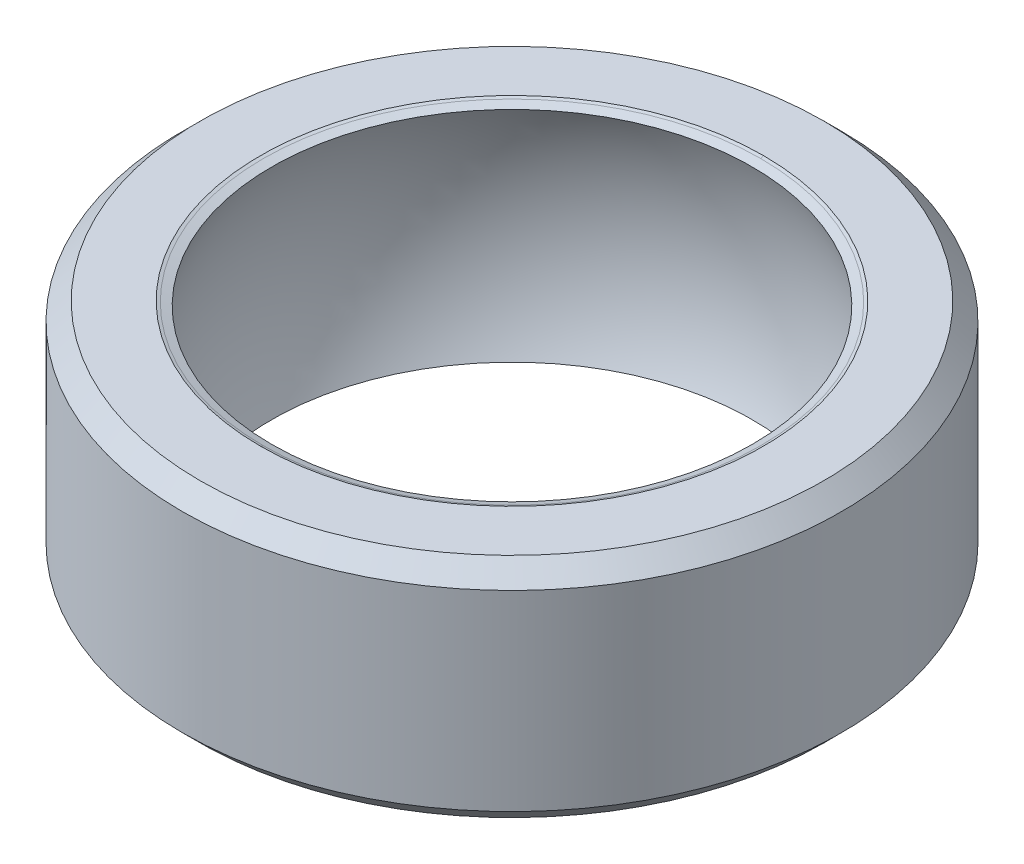
ISO-10303-21;
HEADER;
FILE_DESCRIPTION(('STEP AP214'),'2;1');
FILE_NAME('part.step','',(''),(''),'','','');
FILE_SCHEMA(('AUTOMOTIVE_DESIGN { 1 0 10303 214 1 1 1 1 }'));
ENDSEC;
DATA;
#1=APPLICATION_CONTEXT('core data for automotive mechanical design processes');
#2=APPLICATION_PROTOCOL_DEFINITION('international standard','automotive_design',2000,#1);
#3=PRODUCT_CONTEXT('',#1,'mechanical');
#4=PRODUCT('Part','Part','',(#3));
#5=PRODUCT_RELATED_PRODUCT_CATEGORY('part','',(#4));
#6=PRODUCT_DEFINITION_FORMATION('','',#4);
#7=PRODUCT_DEFINITION_CONTEXT('part definition',#1,'design');
#8=PRODUCT_DEFINITION('design','',#6,#7);
#9=PRODUCT_DEFINITION_SHAPE('','',#8);
#10=(LENGTH_UNIT() NAMED_UNIT(*) SI_UNIT(.MILLI.,.METRE.));
#11=(NAMED_UNIT(*) PLANE_ANGLE_UNIT() SI_UNIT($,.RADIAN.));
#12=(NAMED_UNIT(*) SI_UNIT($,.STERADIAN.) SOLID_ANGLE_UNIT());
#13=UNCERTAINTY_MEASURE_WITH_UNIT(LENGTH_MEASURE(1.E-05),#10,'distance_accuracy_value','');
#14=(GEOMETRIC_REPRESENTATION_CONTEXT(3) GLOBAL_UNCERTAINTY_ASSIGNED_CONTEXT((#13)) GLOBAL_UNIT_ASSIGNED_CONTEXT((#10,
#11,#12)) REPRESENTATION_CONTEXT('',''));
#15=CARTESIAN_POINT('',(0.,0.,0.));
#16=DIRECTION('',(0.,0.,1.));
#17=DIRECTION('',(1.,0.,0.));
#18=AXIS2_PLACEMENT_3D('',#15,#16,#17);
#19=CARTESIAN_POINT('',(0.,0.,0.));
#20=DIRECTION('',(0.,-1.,0.));
#21=DIRECTION('',(0.,0.,-1.));
#22=AXIS2_PLACEMENT_3D('',#19,#20,#21);
#23=DEGENERATE_TOROIDAL_SURFACE('',#22,0.00762000000000092,7.52422121857329,.T.);
#24=CARTESIAN_POINT('',(0.,3.12138692186181,0.));
#25=DIRECTION('',(0.,1.,0.));
#26=DIRECTION('',(1.,0.,0.));
#27=AXIS2_PLACEMENT_3D('',#24,#25,#26);
#28=CIRCLE('',#27,6.85384878886452);
#29=CARTESIAN_POINT('',(6.85384878886452,3.12138692186181,0.));
#30=VERTEX_POINT('',#29);
#31=EDGE_CURVE('E125',#30,#30,#28,.T.);
#32=ORIENTED_EDGE('',*,*,#31,.T.);
#33=EDGE_LOOP('',(#32));
#34=FACE_BOUND('',#33,.T.);
#35=CARTESIAN_POINT('',(0.,-3.12138692189023,0.));
#36=DIRECTION('',(0.,-1.,0.));
#37=DIRECTION('',(1.,0.,0.));
#38=AXIS2_PLACEMENT_3D('',#35,#36,#37);
#39=CIRCLE('',#38,6.85384878880768);
#40=CARTESIAN_POINT('',(6.85384878880768,-3.12138692189023,0.));
#41=VERTEX_POINT('',#40);
#42=EDGE_CURVE('E129',#41,#41,#39,.T.);
#43=ORIENTED_EDGE('',*,*,#42,.T.);
#44=EDGE_LOOP('',(#43));
#45=FACE_BOUND('',#44,.T.);
#46=ADVANCED_FACE('F16',(#34,#45),#23,.F.);
#47=CARTESIAN_POINT('',(0.,-3.20848073371849,0.));
#48=DIRECTION('',(0.,-1.,0.));
#49=DIRECTION('',(1.,0.,0.));
#50=AXIS2_PLACEMENT_3D('',#47,#48,#49);
#51=CONICAL_SURFACE('',#50,7.09326707806213,1.22190500926642);
#52=ORIENTED_EDGE('',*,*,#42,.F.);
#53=EDGE_LOOP('',(#52));
#54=FACE_BOUND('',#53,.T.);
#55=CARTESIAN_POINT('',(0.,-3.2084807338012,0.));
#56=DIRECTION('',(0.,-1.,0.));
#57=DIRECTION('',(-1.,0.,0.));
#58=AXIS2_PLACEMENT_3D('',#55,#56,#57);
#59=CIRCLE('',#58,7.0932670782895);
#60=CARTESIAN_POINT('',(-7.09326914803703,-3.20847333234299,0.));
#61=VERTEX_POINT('',#60);
#62=CARTESIAN_POINT('',(0.,-3.20847345069136,-7.09326951839364));
#63=VERTEX_POINT('',#62);
#64=EDGE_CURVE('E365',#61,#63,#59,.T.);
#65=ORIENTED_EDGE('',*,*,#64,.T.);
#66=CARTESIAN_POINT('',(0.,-3.2084807338012,0.));
#67=DIRECTION('',(0.,-1.,0.));
#68=DIRECTION('',(0.,0.,-1.));
#69=AXIS2_PLACEMENT_3D('',#66,#67,#68);
#70=CIRCLE('',#69,7.0932670782895);
#71=CARTESIAN_POINT('',(0.,-3.20847343916724,7.09326941906428));
#72=VERTEX_POINT('',#71);
#73=EDGE_CURVE('E68',#63,#72,#70,.T.);
#74=ORIENTED_EDGE('',*,*,#73,.T.);
#75=CARTESIAN_POINT('',(0.,-3.20848033326683,0.));
#76=DIRECTION('',(0.,-1.,0.));
#77=DIRECTION('',(0.,0.,1.));
#78=AXIS2_PLACEMENT_3D('',#75,#76,#77);
#79=CIRCLE('',#78,7.09326597723248);
#80=EDGE_CURVE('E128',#72,#61,#79,.T.);
#81=ORIENTED_EDGE('',*,*,#80,.T.);
#82=EDGE_LOOP('',(#65,#74,#81));
#83=FACE_BOUND('',#82,.T.);
#84=ADVANCED_FACE('F267',(#54,#83),#51,.F.);
#85=CARTESIAN_POINT('',(0.,3.20848073371849,0.));
#86=DIRECTION('',(0.,1.,0.));
#87=DIRECTION('',(0.,0.,1.));
#88=AXIS2_PLACEMENT_3D('',#85,#86,#87);
#89=CONICAL_SURFACE('',#88,7.09326707823266,1.22190500937126);
#90=ORIENTED_EDGE('',*,*,#31,.F.);
#91=EDGE_LOOP('',(#90));
#92=FACE_BOUND('',#91,.T.);
#93=CARTESIAN_POINT('',(0.,3.20848073371849,0.));
#94=DIRECTION('',(0.,1.,0.));
#95=DIRECTION('',(-1.,0.,0.));
#96=AXIS2_PLACEMENT_3D('',#93,#94,#95);
#97=CIRCLE('',#96,7.09326707823266);
#98=CARTESIAN_POINT('',(-7.09326914800861,3.20847333230164,0.));
#99=VERTEX_POINT('',#98);
#100=CARTESIAN_POINT('',(0.,3.20847338417803,7.0932693357914));
#101=VERTEX_POINT('',#100);
#102=EDGE_CURVE('E53',#99,#101,#97,.T.);
#103=ORIENTED_EDGE('',*,*,#102,.T.);
#104=CARTESIAN_POINT('',(0.,3.20848073371849,0.));
#105=DIRECTION('',(0.,1.,0.));
#106=DIRECTION('',(0.,0.,1.));
#107=AXIS2_PLACEMENT_3D('',#104,#105,#106);
#108=CIRCLE('',#107,7.09326707823266);
#109=CARTESIAN_POINT('',(0.,3.20847343912586,-7.09326941903571));
#110=VERTEX_POINT('',#109);
#111=EDGE_CURVE('E71',#101,#110,#108,.T.);
#112=ORIENTED_EDGE('',*,*,#111,.T.);
#113=CARTESIAN_POINT('',(0.,3.20848033318412,0.));
#114=DIRECTION('',(0.,1.,0.));
#115=DIRECTION('',(0.,0.,-1.));
#116=AXIS2_PLACEMENT_3D('',#113,#114,#115);
#117=CIRCLE('',#116,7.09326597717563);
#118=EDGE_CURVE('E76',#110,#99,#117,.T.);
#119=ORIENTED_EDGE('',*,*,#118,.T.);
#120=EDGE_LOOP('',(#103,#112,#119));
#121=FACE_BOUND('',#120,.T.);
#122=ADVANCED_FACE('F74',(#92,#121),#89,.F.);
#123=CARTESIAN_POINT('',(0.,-3.23849999992376,0.));
#124=DIRECTION('',(0.,-1.,0.));
#125=DIRECTION('',(1.,0.,0.));
#126=AXIS2_PLACEMENT_3D('',#123,#124,#125);
#127=CONICAL_SURFACE('',#126,7.17578914486694,1.22173047635966);
#128=ORIENTED_EDGE('',*,*,#64,.F.);
#129=ORIENTED_EDGE('',*,*,#80,.F.);
#130=DIRECTION('',(0.,0.34202014332567,-0.939692620785908));
#131=VECTOR('',#130,1.);
#132=CARTESIAN_POINT('',(5.10278230133358E-11,-181621.773625179,499000.));
#133=LINE('',#132,#131);
#134=CARTESIAN_POINT('',(0.,-3.23849999998583,7.17578914503747));
#135=VERTEX_POINT('',#134);
#136=EDGE_CURVE('E133',#72,#135,#133,.F.);
#137=ORIENTED_EDGE('',*,*,#136,.T.);
#138=CARTESIAN_POINT('',(0.,-3.23849999998583,0.));
#139=DIRECTION('',(0.,-1.,0.));
#140=DIRECTION('',(1.,0.,0.));
#141=AXIS2_PLACEMENT_3D('',#138,#139,#140);
#142=CIRCLE('',#141,7.17578914503747);
#143=CARTESIAN_POINT('',(0.,-3.23849999998583,-7.17578914503747));
#144=VERTEX_POINT('',#143);
#145=EDGE_CURVE('E19',#144,#135,#142,.F.);
#146=ORIENTED_EDGE('',*,*,#145,.F.);
#147=DIRECTION('',(0.,0.342020143325669,0.939692620785908));
#148=VECTOR('',#147,1.);
#149=CARTESIAN_POINT('',(-1.00820522641172E-11,-181621.773625179,-499000.));
#150=LINE('',#149,#148);
#151=EDGE_CURVE('E79',#144,#63,#150,.T.);
#152=ORIENTED_EDGE('',*,*,#151,.T.);
#153=EDGE_LOOP('',(#128,#129,#137,#146,#152));
#154=FACE_BOUND('',#153,.T.);
#155=ADVANCED_FACE('F250',(#154),#127,.F.);
#156=CARTESIAN_POINT('',(0.,-3.23849999992376,0.));
#157=DIRECTION('',(0.,-1.,0.));
#158=DIRECTION('',(1.,0.,0.));
#159=AXIS2_PLACEMENT_3D('',#156,#157,#158);
#160=CONICAL_SURFACE('',#159,7.17578914486694,1.22173047630567);
#161=CARTESIAN_POINT('',(0.,-3.23849999998583,0.));
#162=DIRECTION('',(0.,-1.,0.));
#163=DIRECTION('',(1.,0.,0.));
#164=AXIS2_PLACEMENT_3D('',#161,#162,#163);
#165=CIRCLE('',#164,7.17578914503747);
#166=EDGE_CURVE('E160',#135,#144,#165,.F.);
#167=ORIENTED_EDGE('',*,*,#166,.F.);
#168=ORIENTED_EDGE('',*,*,#136,.F.);
#169=ORIENTED_EDGE('',*,*,#73,.F.);
#170=ORIENTED_EDGE('',*,*,#151,.F.);
#171=EDGE_LOOP('',(#167,#168,#169,#170));
#172=FACE_BOUND('',#171,.T.);
#173=ADVANCED_FACE('F242',(#172),#160,.F.);
#174=CARTESIAN_POINT('',(0.,3.23849999992376,0.));
#175=DIRECTION('',(0.,1.,0.));
#176=DIRECTION('',(-1.,0.,0.));
#177=AXIS2_PLACEMENT_3D('',#174,#175,#176);
#178=CONICAL_SURFACE('',#177,7.17578914486694,1.22173047630567);
#179=ORIENTED_EDGE('',*,*,#111,.F.);
#180=DIRECTION('',(0.,-0.34202014332567,-0.939692620785908));
#181=VECTOR('',#180,1.);
#182=CARTESIAN_POINT('',(-2.58227915002348E-11,181621.773625179,499000.));
#183=LINE('',#182,#181);
#184=CARTESIAN_POINT('',(0.,3.23849999998583,7.17578914503747));
#185=VERTEX_POINT('',#184);
#186=EDGE_CURVE('E34',#101,#185,#183,.F.);
#187=ORIENTED_EDGE('',*,*,#186,.T.);
#188=CARTESIAN_POINT('',(0.,3.23849999998583,0.));
#189=DIRECTION('',(0.,1.,0.));
#190=DIRECTION('',(-1.,0.,0.));
#191=AXIS2_PLACEMENT_3D('',#188,#189,#190);
#192=CIRCLE('',#191,7.17578914503747);
#193=CARTESIAN_POINT('',(0.,3.23849999998583,-7.17578914503747));
#194=VERTEX_POINT('',#193);
#195=EDGE_CURVE('E86',#194,#185,#192,.F.);
#196=ORIENTED_EDGE('',*,*,#195,.F.);
#197=DIRECTION('',(0.,-0.342020143325669,0.939692620785908));
#198=VECTOR('',#197,1.);
#199=CARTESIAN_POINT('',(3.52870837772181E-11,181621.773625179,-499000.));
#200=LINE('',#199,#198);
#201=EDGE_CURVE('E83',#194,#110,#200,.T.);
#202=ORIENTED_EDGE('',*,*,#201,.T.);
#203=EDGE_LOOP('',(#179,#187,#196,#202));
#204=FACE_BOUND('',#203,.T.);
#205=ADVANCED_FACE('F84',(#204),#178,.F.);
#206=CARTESIAN_POINT('',(0.,3.23849999992376,0.));
#207=DIRECTION('',(0.,1.,0.));
#208=DIRECTION('',(-1.,0.,0.));
#209=AXIS2_PLACEMENT_3D('',#206,#207,#208);
#210=CONICAL_SURFACE('',#209,7.17578914486694,1.22173047635966);
#211=CARTESIAN_POINT('',(0.,3.23849999998583,0.));
#212=DIRECTION('',(0.,1.,0.));
#213=DIRECTION('',(-1.,0.,0.));
#214=AXIS2_PLACEMENT_3D('',#211,#212,#213);
#215=CIRCLE('',#214,7.17578914503747);
#216=EDGE_CURVE('E152',#185,#194,#215,.F.);
#217=ORIENTED_EDGE('',*,*,#216,.F.);
#218=ORIENTED_EDGE('',*,*,#186,.F.);
#219=ORIENTED_EDGE('',*,*,#102,.F.);
#220=ORIENTED_EDGE('',*,*,#118,.F.);
#221=ORIENTED_EDGE('',*,*,#201,.F.);
#222=EDGE_LOOP('',(#217,#218,#219,#220,#221));
#223=FACE_BOUND('',#222,.T.);
#224=ADVANCED_FACE('F91',(#223),#210,.F.);
#225=CARTESIAN_POINT('',(0.,-3.2385,0.));
#226=DIRECTION('',(0.,-1.,0.));
#227=DIRECTION('',(0.,0.,-1.));
#228=AXIS2_PLACEMENT_3D('',#225,#226,#227);
#229=PLANE('',#228);
#230=CARTESIAN_POINT('',(0.,-3.2385,0.));
#231=DIRECTION('',(0.,1.,0.));
#232=DIRECTION('',(-1.,0.,0.));
#233=AXIS2_PLACEMENT_3D('',#230,#231,#232);
#234=CIRCLE('',#233,8.89);
#235=CARTESIAN_POINT('',(-8.89,-3.2385,0.));
#236=VERTEX_POINT('',#235);
#237=EDGE_CURVE('E147',#236,#236,#234,.T.);
#238=ORIENTED_EDGE('',*,*,#237,.F.);
#239=EDGE_LOOP('',(#238));
#240=FACE_BOUND('',#239,.T.);
#241=ORIENTED_EDGE('',*,*,#145,.T.);
#242=ORIENTED_EDGE('',*,*,#166,.T.);
#243=EDGE_LOOP('',(#241,#242));
#244=FACE_BOUND('',#243,.T.);
#245=ADVANCED_FACE('F111',(#240,#244),#229,.T.);
#246=CARTESIAN_POINT('',(0.,3.2385,0.));
#247=DIRECTION('',(0.,1.,0.));
#248=DIRECTION('',(0.,0.,1.));
#249=AXIS2_PLACEMENT_3D('',#246,#247,#248);
#250=PLANE('',#249);
#251=CARTESIAN_POINT('',(0.,3.2385,0.));
#252=DIRECTION('',(0.,-1.,0.));
#253=DIRECTION('',(0.,0.,-1.));
#254=AXIS2_PLACEMENT_3D('',#251,#252,#253);
#255=CIRCLE('',#254,8.89);
#256=CARTESIAN_POINT('',(0.,3.2385,-8.89));
#257=VERTEX_POINT('',#256);
#258=EDGE_CURVE('E143',#257,#257,#255,.T.);
#259=ORIENTED_EDGE('',*,*,#258,.F.);
#260=EDGE_LOOP('',(#259));
#261=FACE_BOUND('',#260,.T.);
#262=ORIENTED_EDGE('',*,*,#195,.T.);
#263=ORIENTED_EDGE('',*,*,#216,.T.);
#264=EDGE_LOOP('',(#262,#263));
#265=FACE_BOUND('',#264,.T.);
#266=ADVANCED_FACE('F165',(#261,#265),#250,.T.);
#267=CARTESIAN_POINT('',(0.,-2.7305,0.));
#268=DIRECTION('',(0.,1.,0.));
#269=DIRECTION('',(-1.,0.,0.));
#270=AXIS2_PLACEMENT_3D('',#267,#268,#269);
#271=CONICAL_SURFACE('',#270,9.398,0.785398163397449);
#272=ORIENTED_EDGE('',*,*,#237,.T.);
#273=EDGE_LOOP('',(#272));
#274=FACE_BOUND('',#273,.T.);
#275=CARTESIAN_POINT('',(0.,-2.7305,0.));
#276=DIRECTION('',(0.,1.,0.));
#277=DIRECTION('',(0.,0.,1.));
#278=AXIS2_PLACEMENT_3D('',#275,#276,#277);
#279=CIRCLE('',#278,9.398);
#280=CARTESIAN_POINT('',(0.,-2.7305,9.398));
#281=VERTEX_POINT('',#280);
#282=EDGE_CURVE('E25',#281,#281,#279,.T.);
#283=ORIENTED_EDGE('',*,*,#282,.F.);
#284=EDGE_LOOP('',(#283));
#285=FACE_BOUND('',#284,.T.);
#286=ADVANCED_FACE('F171',(#274,#285),#271,.T.);
#287=CARTESIAN_POINT('',(0.,2.7305,0.));
#288=DIRECTION('',(0.,-1.,0.));
#289=DIRECTION('',(0.,0.,-1.));
#290=AXIS2_PLACEMENT_3D('',#287,#288,#289);
#291=CONICAL_SURFACE('',#290,9.398,0.785398163397449);
#292=ORIENTED_EDGE('',*,*,#258,.T.);
#293=EDGE_LOOP('',(#292));
#294=FACE_BOUND('',#293,.T.);
#295=CARTESIAN_POINT('',(0.,2.7305,0.));
#296=DIRECTION('',(0.,1.,0.));
#297=DIRECTION('',(0.,0.,1.));
#298=AXIS2_PLACEMENT_3D('',#295,#296,#297);
#299=CIRCLE('',#298,9.398);
#300=CARTESIAN_POINT('',(0.,2.7305,9.398));
#301=VERTEX_POINT('',#300);
#302=EDGE_CURVE('E10',#301,#301,#299,.F.);
#303=ORIENTED_EDGE('',*,*,#302,.F.);
#304=EDGE_LOOP('',(#303));
#305=FACE_BOUND('',#304,.T.);
#306=ADVANCED_FACE('F176',(#294,#305),#291,.T.);
#307=CARTESIAN_POINT('',(0.,0.,0.));
#308=DIRECTION('',(0.,1.,0.));
#309=DIRECTION('',(0.,0.,1.));
#310=AXIS2_PLACEMENT_3D('',#307,#308,#309);
#311=CYLINDRICAL_SURFACE('',#310,9.398);
#312=ORIENTED_EDGE('',*,*,#282,.T.);
#313=EDGE_LOOP('',(#312));
#314=FACE_BOUND('',#313,.T.);
#315=ORIENTED_EDGE('',*,*,#302,.T.);
#316=EDGE_LOOP('',(#315));
#317=FACE_BOUND('',#316,.T.);
#318=ADVANCED_FACE('F174',(#314,#317),#311,.T.);
#319=CLOSED_SHELL('',(#46,#84,#122,#155,#173,#205,#224,#245,#266,#286,#306,#318));
#320=MANIFOLD_SOLID_BREP('B1',#319);
#321=ADVANCED_BREP_SHAPE_REPRESENTATION('',(#18,#320),#14);
#322=SHAPE_DEFINITION_REPRESENTATION(#9,#321);
ENDSEC;
END-ISO-10303-21;
